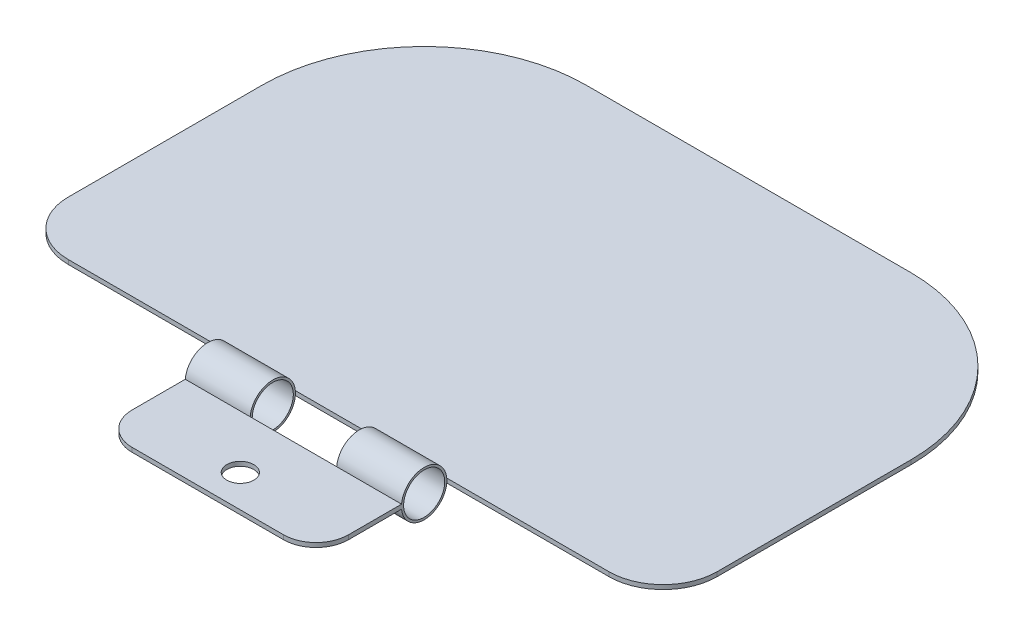
ISO-10303-21;
HEADER;
FILE_DESCRIPTION(('STEP AP214'),'2;1');
FILE_NAME('part.step','',(''),(''),'','','');
FILE_SCHEMA(('AUTOMOTIVE_DESIGN { 1 0 10303 214 1 1 1 1 }'));
ENDSEC;
DATA;
#1=APPLICATION_CONTEXT('core data for automotive mechanical design processes');
#2=APPLICATION_PROTOCOL_DEFINITION('international standard','automotive_design',2000,#1);
#3=PRODUCT_CONTEXT('',#1,'mechanical');
#4=PRODUCT('Part','Part','',(#3));
#5=PRODUCT_RELATED_PRODUCT_CATEGORY('part','',(#4));
#6=PRODUCT_DEFINITION_FORMATION('','',#4);
#7=PRODUCT_DEFINITION_CONTEXT('part definition',#1,'design');
#8=PRODUCT_DEFINITION('design','',#6,#7);
#9=PRODUCT_DEFINITION_SHAPE('','',#8);
#10=(LENGTH_UNIT() NAMED_UNIT(*) SI_UNIT(.MILLI.,.METRE.));
#11=(NAMED_UNIT(*) PLANE_ANGLE_UNIT() SI_UNIT($,.RADIAN.));
#12=(NAMED_UNIT(*) SI_UNIT($,.STERADIAN.) SOLID_ANGLE_UNIT());
#13=UNCERTAINTY_MEASURE_WITH_UNIT(LENGTH_MEASURE(1.E-05),#10,'distance_accuracy_value','');
#14=(GEOMETRIC_REPRESENTATION_CONTEXT(3) GLOBAL_UNCERTAINTY_ASSIGNED_CONTEXT((#13)) GLOBAL_UNIT_ASSIGNED_CONTEXT((#10,
#11,#12)) REPRESENTATION_CONTEXT('',''));
#15=CARTESIAN_POINT('',(0.,0.,0.));
#16=DIRECTION('',(0.,0.,1.));
#17=DIRECTION('',(1.,0.,0.));
#18=AXIS2_PLACEMENT_3D('',#15,#16,#17);
#19=CARTESIAN_POINT('',(20.,0.,0.));
#20=DIRECTION('',(-1.,0.,0.));
#21=DIRECTION('',(0.,0.,1.));
#22=AXIS2_PLACEMENT_3D('',#19,#20,#21);
#23=CYLINDRICAL_SURFACE('',#22,2.1);
#24=DIRECTION('',(-1.,0.,0.));
#25=VECTOR('',#24,1.);
#26=CARTESIAN_POINT('',(20.,-0.200000000000001,-2.09045449603669));
#27=LINE('',#26,#25);
#28=CARTESIAN_POINT('',(6.,-0.200000000000001,-2.09045449603669));
#29=VERTEX_POINT('',#28);
#30=CARTESIAN_POINT('',(0.,-0.200000000000001,-2.09045449603669));
#31=VERTEX_POINT('',#30);
#32=EDGE_CURVE('E177',#29,#31,#27,.T.);
#33=ORIENTED_EDGE('',*,*,#32,.F.);
#34=CARTESIAN_POINT('',(6.,0.,0.));
#35=DIRECTION('',(-1.,0.,0.));
#36=DIRECTION('',(0.,0.,1.));
#37=AXIS2_PLACEMENT_3D('',#34,#35,#36);
#38=CIRCLE('',#37,2.1);
#39=CARTESIAN_POINT('',(6.,-0.199999999999999,2.09045449603669));
#40=VERTEX_POINT('',#39);
#41=EDGE_CURVE('E172',#29,#40,#38,.T.);
#42=ORIENTED_EDGE('',*,*,#41,.T.);
#43=DIRECTION('',(-1.,0.,0.));
#44=VECTOR('',#43,1.);
#45=CARTESIAN_POINT('',(20.,-0.2,2.09045449603669));
#46=LINE('',#45,#44);
#47=CARTESIAN_POINT('',(0.,-0.2,2.09045449603669));
#48=VERTEX_POINT('',#47);
#49=EDGE_CURVE('E175',#40,#48,#46,.T.);
#50=ORIENTED_EDGE('',*,*,#49,.T.);
#51=CARTESIAN_POINT('',(0.,0.,0.));
#52=DIRECTION('',(1.,0.,0.));
#53=DIRECTION('',(0.,0.,-1.));
#54=AXIS2_PLACEMENT_3D('',#51,#52,#53);
#55=CIRCLE('',#54,2.1);
#56=EDGE_CURVE('E329',#48,#31,#55,.T.);
#57=ORIENTED_EDGE('',*,*,#56,.T.);
#58=EDGE_LOOP('',(#33,#42,#50,#57));
#59=FACE_BOUND('',#58,.T.);
#60=ADVANCED_FACE('F31',(#59),#23,.T.);
#61=CARTESIAN_POINT('',(20.,0.,0.));
#62=DIRECTION('',(-1.,0.,0.));
#63=DIRECTION('',(0.,0.,1.));
#64=AXIS2_PLACEMENT_3D('',#61,#62,#63);
#65=CYLINDRICAL_SURFACE('',#64,2.1);
#66=DIRECTION('',(-1.,0.,0.));
#67=VECTOR('',#66,1.);
#68=CARTESIAN_POINT('',(20.,0.2,2.09045449603669));
#69=LINE('',#68,#67);
#70=CARTESIAN_POINT('',(6.,0.2,2.09045449603669));
#71=VERTEX_POINT('',#70);
#72=CARTESIAN_POINT('',(0.,0.2,2.09045449603669));
#73=VERTEX_POINT('',#72);
#74=EDGE_CURVE('E338',#71,#73,#69,.T.);
#75=ORIENTED_EDGE('',*,*,#74,.F.);
#76=CARTESIAN_POINT('',(6.,0.,0.));
#77=DIRECTION('',(-1.,0.,0.));
#78=DIRECTION('',(0.,0.,1.));
#79=AXIS2_PLACEMENT_3D('',#76,#77,#78);
#80=CIRCLE('',#79,2.1);
#81=CARTESIAN_POINT('',(6.,0.199999999999999,-2.09045449603669));
#82=VERTEX_POINT('',#81);
#83=EDGE_CURVE('E180',#71,#82,#80,.T.);
#84=ORIENTED_EDGE('',*,*,#83,.T.);
#85=DIRECTION('',(-1.,0.,0.));
#86=VECTOR('',#85,1.);
#87=CARTESIAN_POINT('',(20.,0.2,-2.09045449603669));
#88=LINE('',#87,#86);
#89=CARTESIAN_POINT('',(0.,0.2,-2.09045449603669));
#90=VERTEX_POINT('',#89);
#91=EDGE_CURVE('E341',#82,#90,#88,.T.);
#92=ORIENTED_EDGE('',*,*,#91,.T.);
#93=CARTESIAN_POINT('',(0.,0.,0.));
#94=DIRECTION('',(1.,0.,0.));
#95=DIRECTION('',(0.,0.,-1.));
#96=AXIS2_PLACEMENT_3D('',#93,#94,#95);
#97=CIRCLE('',#96,2.1);
#98=EDGE_CURVE('E331',#90,#73,#97,.T.);
#99=ORIENTED_EDGE('',*,*,#98,.T.);
#100=EDGE_LOOP('',(#75,#84,#92,#99));
#101=FACE_BOUND('',#100,.T.);
#102=ADVANCED_FACE('F369',(#101),#65,.T.);
#103=CARTESIAN_POINT('',(20.,0.,0.));
#104=DIRECTION('',(-1.,0.,0.));
#105=DIRECTION('',(0.,0.,1.));
#106=AXIS2_PLACEMENT_3D('',#103,#104,#105);
#107=CYLINDRICAL_SURFACE('',#106,1.9);
#108=CARTESIAN_POINT('',(14.,0.,0.));
#109=DIRECTION('',(1.,0.,0.));
#110=DIRECTION('',(0.,0.,-1.));
#111=AXIS2_PLACEMENT_3D('',#108,#109,#110);
#112=CIRCLE('',#111,1.9);
#113=CARTESIAN_POINT('',(14.,0.,-1.9));
#114=VERTEX_POINT('',#113);
#115=EDGE_CURVE('E35',#114,#114,#112,.T.);
#116=ORIENTED_EDGE('',*,*,#115,.F.);
#117=EDGE_LOOP('',(#116));
#118=FACE_BOUND('',#117,.T.);
#119=CARTESIAN_POINT('',(20.,0.,0.));
#120=DIRECTION('',(1.,0.,0.));
#121=DIRECTION('',(0.,0.,-1.));
#122=AXIS2_PLACEMENT_3D('',#119,#120,#121);
#123=CIRCLE('',#122,1.9);
#124=CARTESIAN_POINT('',(20.,0.,-1.9));
#125=VERTEX_POINT('',#124);
#126=EDGE_CURVE('E312',#125,#125,#123,.T.);
#127=ORIENTED_EDGE('',*,*,#126,.T.);
#128=EDGE_LOOP('',(#127));
#129=FACE_BOUND('',#128,.T.);
#130=ADVANCED_FACE('F448',(#118,#129),#107,.F.);
#131=CARTESIAN_POINT('',(20.,0.,0.));
#132=DIRECTION('',(1.,0.,0.));
#133=DIRECTION('',(0.,0.,-1.));
#134=AXIS2_PLACEMENT_3D('',#131,#132,#133);
#135=PLANE('',#134);
#136=DIRECTION('',(0.,0.,1.));
#137=VECTOR('',#136,1.);
#138=CARTESIAN_POINT('',(20.,0.2,10.));
#139=LINE('',#138,#137);
#140=CARTESIAN_POINT('',(20.,0.2,2.09045449603669));
#141=VERTEX_POINT('',#140);
#142=CARTESIAN_POINT('',(20.,0.2,7.));
#143=VERTEX_POINT('',#142);
#144=EDGE_CURVE('E324',#141,#143,#139,.T.);
#145=ORIENTED_EDGE('',*,*,#144,.T.);
#146=DIRECTION('',(0.,-1.,0.));
#147=VECTOR('',#146,1.);
#148=CARTESIAN_POINT('',(20.,-0.2,7.));
#149=LINE('',#148,#147);
#150=CARTESIAN_POINT('',(20.,-0.2,7.));
#151=VERTEX_POINT('',#150);
#152=EDGE_CURVE('E250',#143,#151,#149,.T.);
#153=ORIENTED_EDGE('',*,*,#152,.T.);
#154=DIRECTION('',(0.,0.,-1.));
#155=VECTOR('',#154,1.);
#156=CARTESIAN_POINT('',(20.,-0.2,10.));
#157=LINE('',#156,#155);
#158=CARTESIAN_POINT('',(20.,-0.2,2.09045449603669));
#159=VERTEX_POINT('',#158);
#160=EDGE_CURVE('E317',#151,#159,#157,.T.);
#161=ORIENTED_EDGE('',*,*,#160,.T.);
#162=CARTESIAN_POINT('',(20.,0.,0.));
#163=DIRECTION('',(1.,0.,0.));
#164=DIRECTION('',(0.,0.,-1.));
#165=AXIS2_PLACEMENT_3D('',#162,#163,#164);
#166=CIRCLE('',#165,2.1);
#167=CARTESIAN_POINT('',(20.,-0.200000000000001,-2.09045449603669));
#168=VERTEX_POINT('',#167);
#169=EDGE_CURVE('E319',#159,#168,#166,.T.);
#170=ORIENTED_EDGE('',*,*,#169,.T.);
#171=DIRECTION('',(0.,-1.,0.));
#172=VECTOR('',#171,1.);
#173=CARTESIAN_POINT('',(20.,0.,-2.09045449603669));
#174=LINE('',#173,#172);
#175=CARTESIAN_POINT('',(20.,0.2,-2.09045449603669));
#176=VERTEX_POINT('',#175);
#177=EDGE_CURVE('E308',#176,#168,#174,.T.);
#178=ORIENTED_EDGE('',*,*,#177,.F.);
#179=CARTESIAN_POINT('',(20.,0.,0.));
#180=DIRECTION('',(1.,0.,0.));
#181=DIRECTION('',(0.,0.,-1.));
#182=AXIS2_PLACEMENT_3D('',#179,#180,#181);
#183=CIRCLE('',#182,2.1);
#184=EDGE_CURVE('E322',#176,#141,#183,.T.);
#185=ORIENTED_EDGE('',*,*,#184,.T.);
#186=EDGE_LOOP('',(#145,#153,#161,#170,#178,#185));
#187=FACE_BOUND('',#186,.T.);
#188=ORIENTED_EDGE('',*,*,#126,.F.);
#189=EDGE_LOOP('',(#188));
#190=FACE_BOUND('',#189,.T.);
#191=ADVANCED_FACE('F409',(#187,#190),#135,.T.);
#192=CARTESIAN_POINT('',(0.,0.,0.));
#193=DIRECTION('',(1.,0.,0.));
#194=DIRECTION('',(0.,0.,-1.));
#195=AXIS2_PLACEMENT_3D('',#192,#193,#194);
#196=PLANE('',#195);
#197=DIRECTION('',(0.,0.,-1.));
#198=VECTOR('',#197,1.);
#199=CARTESIAN_POINT('',(0.,-0.2,10.));
#200=LINE('',#199,#198);
#201=CARTESIAN_POINT('',(0.,-0.2,7.));
#202=VERTEX_POINT('',#201);
#203=EDGE_CURVE('E200',#202,#48,#200,.T.);
#204=ORIENTED_EDGE('',*,*,#203,.F.);
#205=DIRECTION('',(0.,-1.,0.));
#206=VECTOR('',#205,1.);
#207=CARTESIAN_POINT('',(0.,0.,7.));
#208=LINE('',#207,#206);
#209=CARTESIAN_POINT('',(0.,0.2,7.));
#210=VERTEX_POINT('',#209);
#211=EDGE_CURVE('E11',#202,#210,#208,.F.);
#212=ORIENTED_EDGE('',*,*,#211,.T.);
#213=DIRECTION('',(0.,0.,1.));
#214=VECTOR('',#213,1.);
#215=CARTESIAN_POINT('',(0.,0.2,10.));
#216=LINE('',#215,#214);
#217=EDGE_CURVE('E320',#73,#210,#216,.T.);
#218=ORIENTED_EDGE('',*,*,#217,.F.);
#219=ORIENTED_EDGE('',*,*,#98,.F.);
#220=DIRECTION('',(0.,-1.,0.));
#221=VECTOR('',#220,1.);
#222=CARTESIAN_POINT('',(0.,0.,-2.09045449603669));
#223=LINE('',#222,#221);
#224=EDGE_CURVE('E301',#90,#31,#223,.T.);
#225=ORIENTED_EDGE('',*,*,#224,.T.);
#226=ORIENTED_EDGE('',*,*,#56,.F.);
#227=EDGE_LOOP('',(#204,#212,#218,#219,#225,#226));
#228=FACE_BOUND('',#227,.T.);
#229=CARTESIAN_POINT('',(0.,0.,0.));
#230=DIRECTION('',(1.,0.,0.));
#231=DIRECTION('',(0.,0.,-1.));
#232=AXIS2_PLACEMENT_3D('',#229,#230,#231);
#233=CIRCLE('',#232,1.9);
#234=CARTESIAN_POINT('',(0.,0.,-1.9));
#235=VERTEX_POINT('',#234);
#236=EDGE_CURVE('E311',#235,#235,#233,.T.);
#237=ORIENTED_EDGE('',*,*,#236,.T.);
#238=EDGE_LOOP('',(#237));
#239=FACE_BOUND('',#238,.T.);
#240=ADVANCED_FACE('F365',(#228,#239),#196,.F.);
#241=CARTESIAN_POINT('',(20.,0.2,10.));
#242=DIRECTION('',(0.,0.,-1.));
#243=DIRECTION('',(-1.,0.,0.));
#244=AXIS2_PLACEMENT_3D('',#241,#242,#243);
#245=PLANE('',#244);
#246=DIRECTION('',(-1.,0.,0.));
#247=VECTOR('',#246,1.);
#248=CARTESIAN_POINT('',(20.,-0.2,10.));
#249=LINE('',#248,#247);
#250=CARTESIAN_POINT('',(17.,-0.2,10.));
#251=VERTEX_POINT('',#250);
#252=CARTESIAN_POINT('',(3.,-0.2,10.));
#253=VERTEX_POINT('',#252);
#254=EDGE_CURVE('E205',#251,#253,#249,.T.);
#255=ORIENTED_EDGE('',*,*,#254,.F.);
#256=DIRECTION('',(0.,-1.,0.));
#257=VECTOR('',#256,1.);
#258=CARTESIAN_POINT('',(17.,0.2,10.));
#259=LINE('',#258,#257);
#260=CARTESIAN_POINT('',(17.,0.2,10.));
#261=VERTEX_POINT('',#260);
#262=EDGE_CURVE('E260',#251,#261,#259,.F.);
#263=ORIENTED_EDGE('',*,*,#262,.T.);
#264=DIRECTION('',(-1.,0.,0.));
#265=VECTOR('',#264,1.);
#266=CARTESIAN_POINT('',(20.,0.2,10.));
#267=LINE('',#266,#265);
#268=CARTESIAN_POINT('',(3.,0.2,10.));
#269=VERTEX_POINT('',#268);
#270=EDGE_CURVE('E327',#261,#269,#267,.T.);
#271=ORIENTED_EDGE('',*,*,#270,.T.);
#272=DIRECTION('',(0.,-1.,0.));
#273=VECTOR('',#272,1.);
#274=CARTESIAN_POINT('',(3.,0.2,10.));
#275=LINE('',#274,#273);
#276=EDGE_CURVE('E257',#269,#253,#275,.T.);
#277=ORIENTED_EDGE('',*,*,#276,.T.);
#278=EDGE_LOOP('',(#255,#263,#271,#277));
#279=FACE_BOUND('',#278,.T.);
#280=ADVANCED_FACE('F428',(#279),#245,.F.);
#281=CARTESIAN_POINT('',(20.,-0.2,10.));
#282=DIRECTION('',(0.,1.,0.));
#283=DIRECTION('',(0.,0.,1.));
#284=AXIS2_PLACEMENT_3D('',#281,#282,#283);
#285=PLANE('',#284);
#286=CARTESIAN_POINT('',(10.,-0.199999999999999,7.));
#287=DIRECTION('',(0.,1.,0.));
#288=DIRECTION('',(0.,0.,1.));
#289=AXIS2_PLACEMENT_3D('',#286,#287,#288);
#290=CIRCLE('',#289,1.25);
#291=CARTESIAN_POINT('',(10.,-0.199999999999999,8.25));
#292=VERTEX_POINT('',#291);
#293=EDGE_CURVE('E284',#292,#292,#290,.T.);
#294=ORIENTED_EDGE('',*,*,#293,.T.);
#295=EDGE_LOOP('',(#294));
#296=FACE_BOUND('',#295,.T.);
#297=ORIENTED_EDGE('',*,*,#160,.F.);
#298=CARTESIAN_POINT('',(17.,-0.2,7.));
#299=DIRECTION('',(0.,1.,0.));
#300=DIRECTION('',(0.,0.,1.));
#301=AXIS2_PLACEMENT_3D('',#298,#299,#300);
#302=CIRCLE('',#301,3.);
#303=EDGE_CURVE('E255',#151,#251,#302,.F.);
#304=ORIENTED_EDGE('',*,*,#303,.T.);
#305=ORIENTED_EDGE('',*,*,#254,.T.);
#306=CARTESIAN_POINT('',(3.,-0.2,7.));
#307=DIRECTION('',(0.,1.,0.));
#308=DIRECTION('',(0.,0.,1.));
#309=AXIS2_PLACEMENT_3D('',#306,#307,#308);
#310=CIRCLE('',#309,3.);
#311=EDGE_CURVE('E253',#253,#202,#310,.F.);
#312=ORIENTED_EDGE('',*,*,#311,.T.);
#313=ORIENTED_EDGE('',*,*,#203,.T.);
#314=ORIENTED_EDGE('',*,*,#49,.F.);
#315=DIRECTION('',(-1.,0.,0.));
#316=VECTOR('',#315,1.);
#317=CARTESIAN_POINT('',(20.,-0.199999999999999,2.09045449603669));
#318=LINE('',#317,#316);
#319=CARTESIAN_POINT('',(14.,-0.199999999999999,2.09045449603669));
#320=VERTEX_POINT('',#319);
#321=EDGE_CURVE('E184',#40,#320,#318,.F.);
#322=ORIENTED_EDGE('',*,*,#321,.T.);
#323=EDGE_CURVE('E202',#159,#320,#46,.T.);
#324=ORIENTED_EDGE('',*,*,#323,.F.);
#325=EDGE_LOOP('',(#297,#304,#305,#312,#313,#314,#322,#324));
#326=FACE_BOUND('',#325,.T.);
#327=ADVANCED_FACE('F198',(#296,#326),#285,.F.);
#328=ORIENTED_EDGE('',*,*,#323,.T.);
#329=CARTESIAN_POINT('',(14.,0.,0.));
#330=DIRECTION('',(1.,0.,0.));
#331=DIRECTION('',(0.,0.,-1.));
#332=AXIS2_PLACEMENT_3D('',#329,#330,#331);
#333=CIRCLE('',#332,2.1);
#334=CARTESIAN_POINT('',(14.,-0.2,-2.09045449603669));
#335=VERTEX_POINT('',#334);
#336=EDGE_CURVE('E192',#320,#335,#333,.T.);
#337=ORIENTED_EDGE('',*,*,#336,.T.);
#338=EDGE_CURVE('E203',#168,#335,#27,.T.);
#339=ORIENTED_EDGE('',*,*,#338,.F.);
#340=ORIENTED_EDGE('',*,*,#169,.F.);
#341=EDGE_LOOP('',(#328,#337,#339,#340));
#342=FACE_BOUND('',#341,.T.);
#343=ADVANCED_FACE('F444',(#342),#23,.T.);
#344=CARTESIAN_POINT('',(20.,-0.2,-2.09045449603669));
#345=DIRECTION('',(0.,1.,0.));
#346=DIRECTION('',(0.,0.,1.));
#347=AXIS2_PLACEMENT_3D('',#344,#345,#346);
#348=PLANE('',#347);
#349=DIRECTION('',(0.,0.,-1.));
#350=VECTOR('',#349,1.);
#351=CARTESIAN_POINT('',(40.,-0.2,-40.));
#352=LINE('',#351,#350);
#353=CARTESIAN_POINT('',(40.,-0.200000000000001,-7.09045449603669));
#354=VERTEX_POINT('',#353);
#355=CARTESIAN_POINT('',(40.,-0.2,-25.));
#356=VERTEX_POINT('',#355);
#357=EDGE_CURVE('E287',#354,#356,#352,.T.);
#358=ORIENTED_EDGE('',*,*,#357,.F.);
#359=CARTESIAN_POINT('',(35.,-0.2,-7.09045449603669));
#360=DIRECTION('',(0.,1.,0.));
#361=DIRECTION('',(0.,0.,1.));
#362=AXIS2_PLACEMENT_3D('',#359,#360,#361);
#363=CIRCLE('',#362,5.);
#364=CARTESIAN_POINT('',(35.,-0.200000000000001,-2.09045449603669));
#365=VERTEX_POINT('',#364);
#366=EDGE_CURVE('E237',#354,#365,#363,.F.);
#367=ORIENTED_EDGE('',*,*,#366,.T.);
#368=DIRECTION('',(1.,0.,0.));
#369=VECTOR('',#368,1.);
#370=CARTESIAN_POINT('',(-20.,-0.200000000000001,-2.09045449603669));
#371=LINE('',#370,#369);
#372=EDGE_CURVE('E302',#168,#365,#371,.T.);
#373=ORIENTED_EDGE('',*,*,#372,.F.);
#374=ORIENTED_EDGE('',*,*,#338,.T.);
#375=DIRECTION('',(-1.,0.,0.));
#376=VECTOR('',#375,1.);
#377=CARTESIAN_POINT('',(20.,-0.2,-2.09045449603669));
#378=LINE('',#377,#376);
#379=EDGE_CURVE('E191',#335,#29,#378,.T.);
#380=ORIENTED_EDGE('',*,*,#379,.T.);
#381=ORIENTED_EDGE('',*,*,#32,.T.);
#382=CARTESIAN_POINT('',(-15.,-0.200000000000001,-2.09045449603669));
#383=VERTEX_POINT('',#382);
#384=EDGE_CURVE('E298',#383,#31,#371,.T.);
#385=ORIENTED_EDGE('',*,*,#384,.F.);
#386=CARTESIAN_POINT('',(-15.,-0.2,-7.09045449603669));
#387=DIRECTION('',(0.,1.,0.));
#388=DIRECTION('',(0.,0.,1.));
#389=AXIS2_PLACEMENT_3D('',#386,#387,#388);
#390=CIRCLE('',#389,5.);
#391=CARTESIAN_POINT('',(-20.,-0.200000000000001,-7.09045449603669));
#392=VERTEX_POINT('',#391);
#393=EDGE_CURVE('E235',#383,#392,#390,.F.);
#394=ORIENTED_EDGE('',*,*,#393,.T.);
#395=DIRECTION('',(0.,0.,-1.));
#396=VECTOR('',#395,1.);
#397=CARTESIAN_POINT('',(-20.,-0.2,-40.));
#398=LINE('',#397,#396);
#399=CARTESIAN_POINT('',(-20.,-0.2,-25.));
#400=VERTEX_POINT('',#399);
#401=EDGE_CURVE('E292',#392,#400,#398,.T.);
#402=ORIENTED_EDGE('',*,*,#401,.T.);
#403=CARTESIAN_POINT('',(-5.,-0.2,-25.));
#404=DIRECTION('',(0.,1.,0.));
#405=DIRECTION('',(0.,0.,1.));
#406=AXIS2_PLACEMENT_3D('',#403,#404,#405);
#407=CIRCLE('',#406,15.);
#408=CARTESIAN_POINT('',(-5.,-0.2,-40.));
#409=VERTEX_POINT('',#408);
#410=EDGE_CURVE('E224',#400,#409,#407,.F.);
#411=ORIENTED_EDGE('',*,*,#410,.T.);
#412=DIRECTION('',(-1.,0.,0.));
#413=VECTOR('',#412,1.);
#414=CARTESIAN_POINT('',(20.,-0.2,-40.));
#415=LINE('',#414,#413);
#416=CARTESIAN_POINT('',(25.,-0.2,-40.));
#417=VERTEX_POINT('',#416);
#418=EDGE_CURVE('E349',#417,#409,#415,.T.);
#419=ORIENTED_EDGE('',*,*,#418,.F.);
#420=CARTESIAN_POINT('',(25.,-0.2,-25.));
#421=DIRECTION('',(0.,1.,0.));
#422=DIRECTION('',(0.,0.,1.));
#423=AXIS2_PLACEMENT_3D('',#420,#421,#422);
#424=CIRCLE('',#423,15.);
#425=EDGE_CURVE('E226',#417,#356,#424,.F.);
#426=ORIENTED_EDGE('',*,*,#425,.T.);
#427=EDGE_LOOP('',(#358,#367,#373,#374,#380,#381,#385,#394,#402,#411,#419,#426));
#428=FACE_BOUND('',#427,.T.);
#429=ADVANCED_FACE('F357',(#428),#348,.F.);
#430=CARTESIAN_POINT('',(20.,0.2,-40.));
#431=DIRECTION('',(0.,0.,1.));
#432=DIRECTION('',(1.,0.,0.));
#433=AXIS2_PLACEMENT_3D('',#430,#431,#432);
#434=PLANE('',#433);
#435=DIRECTION('',(-1.,0.,0.));
#436=VECTOR('',#435,1.);
#437=CARTESIAN_POINT('',(20.,0.2,-40.));
#438=LINE('',#437,#436);
#439=CARTESIAN_POINT('',(25.,0.2,-40.));
#440=VERTEX_POINT('',#439);
#441=CARTESIAN_POINT('',(-5.,0.2,-40.));
#442=VERTEX_POINT('',#441);
#443=EDGE_CURVE('E346',#440,#442,#438,.T.);
#444=ORIENTED_EDGE('',*,*,#443,.F.);
#445=DIRECTION('',(0.,1.,0.));
#446=VECTOR('',#445,1.);
#447=CARTESIAN_POINT('',(25.,0.2,-40.));
#448=LINE('',#447,#446);
#449=EDGE_CURVE('E222',#440,#417,#448,.F.);
#450=ORIENTED_EDGE('',*,*,#449,.T.);
#451=ORIENTED_EDGE('',*,*,#418,.T.);
#452=DIRECTION('',(0.,1.,0.));
#453=VECTOR('',#452,1.);
#454=CARTESIAN_POINT('',(-5.,0.2,-40.));
#455=LINE('',#454,#453);
#456=EDGE_CURVE('E219',#409,#442,#455,.T.);
#457=ORIENTED_EDGE('',*,*,#456,.T.);
#458=EDGE_LOOP('',(#444,#450,#451,#457));
#459=FACE_BOUND('',#458,.T.);
#460=ADVANCED_FACE('F458',(#459),#434,.F.);
#461=CARTESIAN_POINT('',(20.,0.2,-2.09045449603669));
#462=DIRECTION('',(0.,-1.,0.));
#463=DIRECTION('',(0.,0.,-1.));
#464=AXIS2_PLACEMENT_3D('',#461,#462,#463);
#465=PLANE('',#464);
#466=DIRECTION('',(1.,0.,0.));
#467=VECTOR('',#466,1.);
#468=CARTESIAN_POINT('',(-20.,0.2,-2.09045449603669));
#469=LINE('',#468,#467);
#470=CARTESIAN_POINT('',(35.,0.2,-2.09045449603669));
#471=VERTEX_POINT('',#470);
#472=EDGE_CURVE('E297',#176,#471,#469,.T.);
#473=ORIENTED_EDGE('',*,*,#472,.T.);
#474=CARTESIAN_POINT('',(35.,0.2,-7.09045449603669));
#475=DIRECTION('',(0.,-1.,0.));
#476=DIRECTION('',(0.,0.,-1.));
#477=AXIS2_PLACEMENT_3D('',#474,#475,#476);
#478=CIRCLE('',#477,5.);
#479=CARTESIAN_POINT('',(40.,0.2,-7.09045449603669));
#480=VERTEX_POINT('',#479);
#481=EDGE_CURVE('E243',#471,#480,#478,.F.);
#482=ORIENTED_EDGE('',*,*,#481,.T.);
#483=DIRECTION('',(0.,0.,1.));
#484=VECTOR('',#483,1.);
#485=CARTESIAN_POINT('',(40.,0.2,-2.09045449603669));
#486=LINE('',#485,#484);
#487=CARTESIAN_POINT('',(40.,0.2,-25.));
#488=VERTEX_POINT('',#487);
#489=EDGE_CURVE('E289',#488,#480,#486,.T.);
#490=ORIENTED_EDGE('',*,*,#489,.F.);
#491=CARTESIAN_POINT('',(25.,0.2,-25.));
#492=DIRECTION('',(0.,-1.,0.));
#493=DIRECTION('',(0.,0.,-1.));
#494=AXIS2_PLACEMENT_3D('',#491,#492,#493);
#495=CIRCLE('',#494,15.);
#496=EDGE_CURVE('E217',#488,#440,#495,.F.);
#497=ORIENTED_EDGE('',*,*,#496,.T.);
#498=ORIENTED_EDGE('',*,*,#443,.T.);
#499=CARTESIAN_POINT('',(-5.,0.2,-25.));
#500=DIRECTION('',(0.,-1.,0.));
#501=DIRECTION('',(0.,0.,-1.));
#502=AXIS2_PLACEMENT_3D('',#499,#500,#501);
#503=CIRCLE('',#502,15.);
#504=CARTESIAN_POINT('',(-20.,0.2,-25.));
#505=VERTEX_POINT('',#504);
#506=EDGE_CURVE('E215',#442,#505,#503,.F.);
#507=ORIENTED_EDGE('',*,*,#506,.T.);
#508=DIRECTION('',(0.,0.,1.));
#509=VECTOR('',#508,1.);
#510=CARTESIAN_POINT('',(-20.,0.2,-2.09045449603669));
#511=LINE('',#510,#509);
#512=CARTESIAN_POINT('',(-20.,0.2,-7.09045449603669));
#513=VERTEX_POINT('',#512);
#514=EDGE_CURVE('E294',#505,#513,#511,.T.);
#515=ORIENTED_EDGE('',*,*,#514,.T.);
#516=CARTESIAN_POINT('',(-15.,0.2,-7.09045449603669));
#517=DIRECTION('',(0.,-1.,0.));
#518=DIRECTION('',(0.,0.,-1.));
#519=AXIS2_PLACEMENT_3D('',#516,#517,#518);
#520=CIRCLE('',#519,5.);
#521=CARTESIAN_POINT('',(-15.,0.2,-2.09045449603669));
#522=VERTEX_POINT('',#521);
#523=EDGE_CURVE('E241',#513,#522,#520,.F.);
#524=ORIENTED_EDGE('',*,*,#523,.T.);
#525=EDGE_CURVE('E303',#522,#90,#469,.T.);
#526=ORIENTED_EDGE('',*,*,#525,.T.);
#527=ORIENTED_EDGE('',*,*,#91,.F.);
#528=CARTESIAN_POINT('',(14.,0.199999999999999,-2.09045449603669));
#529=VERTEX_POINT('',#528);
#530=EDGE_CURVE('E347',#529,#82,#88,.T.);
#531=ORIENTED_EDGE('',*,*,#530,.F.);
#532=EDGE_CURVE('E343',#176,#529,#88,.T.);
#533=ORIENTED_EDGE('',*,*,#532,.F.);
#534=EDGE_LOOP('',(#473,#482,#490,#497,#498,#507,#515,#524,#526,#527,#531,#533));
#535=FACE_BOUND('',#534,.T.);
#536=ADVANCED_FACE('F375',(#535),#465,.F.);
#537=ORIENTED_EDGE('',*,*,#532,.T.);
#538=CARTESIAN_POINT('',(14.,0.,0.));
#539=DIRECTION('',(1.,0.,0.));
#540=DIRECTION('',(0.,0.,-1.));
#541=AXIS2_PLACEMENT_3D('',#538,#539,#540);
#542=CIRCLE('',#541,2.1);
#543=CARTESIAN_POINT('',(14.,0.2,2.09045449603669));
#544=VERTEX_POINT('',#543);
#545=EDGE_CURVE('E277',#529,#544,#542,.T.);
#546=ORIENTED_EDGE('',*,*,#545,.T.);
#547=EDGE_CURVE('E339',#141,#544,#69,.T.);
#548=ORIENTED_EDGE('',*,*,#547,.F.);
#549=ORIENTED_EDGE('',*,*,#184,.F.);
#550=EDGE_LOOP('',(#537,#546,#548,#549));
#551=FACE_BOUND('',#550,.T.);
#552=ADVANCED_FACE('F416',(#551),#65,.T.);
#553=CARTESIAN_POINT('',(20.,0.2,10.));
#554=DIRECTION('',(0.,-1.,0.));
#555=DIRECTION('',(0.,0.,-1.));
#556=AXIS2_PLACEMENT_3D('',#553,#554,#555);
#557=PLANE('',#556);
#558=CARTESIAN_POINT('',(10.,0.2,7.));
#559=DIRECTION('',(0.,1.,0.));
#560=DIRECTION('',(0.,0.,1.));
#561=AXIS2_PLACEMENT_3D('',#558,#559,#560);
#562=CIRCLE('',#561,1.25);
#563=CARTESIAN_POINT('',(10.,0.2,8.25));
#564=VERTEX_POINT('',#563);
#565=EDGE_CURVE('E281',#564,#564,#562,.T.);
#566=ORIENTED_EDGE('',*,*,#565,.F.);
#567=EDGE_LOOP('',(#566));
#568=FACE_BOUND('',#567,.T.);
#569=ORIENTED_EDGE('',*,*,#270,.F.);
#570=CARTESIAN_POINT('',(17.,0.2,7.));
#571=DIRECTION('',(0.,-1.,0.));
#572=DIRECTION('',(0.,0.,-1.));
#573=AXIS2_PLACEMENT_3D('',#570,#571,#572);
#574=CIRCLE('',#573,3.);
#575=EDGE_CURVE('E40',#261,#143,#574,.F.);
#576=ORIENTED_EDGE('',*,*,#575,.T.);
#577=ORIENTED_EDGE('',*,*,#144,.F.);
#578=ORIENTED_EDGE('',*,*,#547,.T.);
#579=EDGE_CURVE('E342',#544,#71,#69,.T.);
#580=ORIENTED_EDGE('',*,*,#579,.T.);
#581=ORIENTED_EDGE('',*,*,#74,.T.);
#582=ORIENTED_EDGE('',*,*,#217,.T.);
#583=CARTESIAN_POINT('',(3.,0.2,7.));
#584=DIRECTION('',(0.,-1.,0.));
#585=DIRECTION('',(0.,0.,-1.));
#586=AXIS2_PLACEMENT_3D('',#583,#584,#585);
#587=CIRCLE('',#586,3.);
#588=EDGE_CURVE('E262',#210,#269,#587,.F.);
#589=ORIENTED_EDGE('',*,*,#588,.T.);
#590=EDGE_LOOP('',(#569,#576,#577,#578,#580,#581,#582,#589));
#591=FACE_BOUND('',#590,.T.);
#592=ADVANCED_FACE('F420',(#568,#591),#557,.F.);
#593=CARTESIAN_POINT('',(6.,0.,0.));
#594=DIRECTION('',(-1.,0.,0.));
#595=DIRECTION('',(0.,0.,1.));
#596=AXIS2_PLACEMENT_3D('',#593,#594,#595);
#597=CIRCLE('',#596,1.9);
#598=CARTESIAN_POINT('',(6.,0.,1.9));
#599=VERTEX_POINT('',#598);
#600=EDGE_CURVE('E264',#599,#599,#597,.T.);
#601=ORIENTED_EDGE('',*,*,#600,.F.);
#602=EDGE_LOOP('',(#601));
#603=FACE_BOUND('',#602,.T.);
#604=ORIENTED_EDGE('',*,*,#236,.F.);
#605=EDGE_LOOP('',(#604));
#606=FACE_BOUND('',#605,.T.);
#607=ADVANCED_FACE('F478',(#603,#606),#107,.F.);
#608=CARTESIAN_POINT('',(-20.,-0.200000000000001,-2.09045449603669));
#609=DIRECTION('',(-1.,0.,0.));
#610=DIRECTION('',(0.,0.,1.));
#611=AXIS2_PLACEMENT_3D('',#608,#609,#610);
#612=PLANE('',#611);
#613=ORIENTED_EDGE('',*,*,#401,.F.);
#614=DIRECTION('',(0.,-1.,0.));
#615=VECTOR('',#614,1.);
#616=CARTESIAN_POINT('',(-20.,-0.200000000000007,-7.09045449603669));
#617=LINE('',#616,#615);
#618=EDGE_CURVE('E248',#392,#513,#617,.F.);
#619=ORIENTED_EDGE('',*,*,#618,.T.);
#620=ORIENTED_EDGE('',*,*,#514,.F.);
#621=DIRECTION('',(0.,1.,0.));
#622=VECTOR('',#621,1.);
#623=CARTESIAN_POINT('',(-20.,-0.2,-25.));
#624=LINE('',#623,#622);
#625=EDGE_CURVE('E229',#505,#400,#624,.F.);
#626=ORIENTED_EDGE('',*,*,#625,.T.);
#627=EDGE_LOOP('',(#613,#619,#620,#626));
#628=FACE_BOUND('',#627,.T.);
#629=ADVANCED_FACE('F382',(#628),#612,.T.);
#630=CARTESIAN_POINT('',(-20.,-0.200000000000001,-2.09045449603669));
#631=DIRECTION('',(0.,0.,1.));
#632=DIRECTION('',(0.,-1.,0.));
#633=AXIS2_PLACEMENT_3D('',#630,#631,#632);
#634=PLANE('',#633);
#635=ORIENTED_EDGE('',*,*,#525,.F.);
#636=DIRECTION('',(0.,-1.,0.));
#637=VECTOR('',#636,1.);
#638=CARTESIAN_POINT('',(-15.,-0.200000000000001,-2.09045449603669));
#639=LINE('',#638,#637);
#640=EDGE_CURVE('E245',#522,#383,#639,.T.);
#641=ORIENTED_EDGE('',*,*,#640,.T.);
#642=ORIENTED_EDGE('',*,*,#384,.T.);
#643=ORIENTED_EDGE('',*,*,#224,.F.);
#644=EDGE_LOOP('',(#635,#641,#642,#643));
#645=FACE_BOUND('',#644,.T.);
#646=ADVANCED_FACE('F361',(#645),#634,.T.);
#647=ORIENTED_EDGE('',*,*,#372,.T.);
#648=DIRECTION('',(0.,-1.,0.));
#649=VECTOR('',#648,1.);
#650=CARTESIAN_POINT('',(35.,0.2,-2.09045449603669));
#651=LINE('',#650,#649);
#652=EDGE_CURVE('E239',#365,#471,#651,.F.);
#653=ORIENTED_EDGE('',*,*,#652,.T.);
#654=ORIENTED_EDGE('',*,*,#472,.F.);
#655=ORIENTED_EDGE('',*,*,#177,.T.);
#656=EDGE_LOOP('',(#647,#653,#654,#655));
#657=FACE_BOUND('',#656,.T.);
#658=ADVANCED_FACE('F407',(#657),#634,.T.);
#659=CARTESIAN_POINT('',(40.,-0.200000000000001,-2.09045449603669));
#660=DIRECTION('',(-1.,0.,0.));
#661=DIRECTION('',(0.,0.,1.));
#662=AXIS2_PLACEMENT_3D('',#659,#660,#661);
#663=PLANE('',#662);
#664=ORIENTED_EDGE('',*,*,#489,.T.);
#665=DIRECTION('',(0.,-1.,0.));
#666=VECTOR('',#665,1.);
#667=CARTESIAN_POINT('',(40.,-0.200000000000007,-7.09045449603669));
#668=LINE('',#667,#666);
#669=EDGE_CURVE('E232',#480,#354,#668,.T.);
#670=ORIENTED_EDGE('',*,*,#669,.T.);
#671=ORIENTED_EDGE('',*,*,#357,.T.);
#672=DIRECTION('',(0.,1.,0.));
#673=VECTOR('',#672,1.);
#674=CARTESIAN_POINT('',(40.,-0.200000000000001,-25.));
#675=LINE('',#674,#673);
#676=EDGE_CURVE('E212',#356,#488,#675,.T.);
#677=ORIENTED_EDGE('',*,*,#676,.T.);
#678=EDGE_LOOP('',(#664,#670,#671,#677));
#679=FACE_BOUND('',#678,.T.);
#680=ADVANCED_FACE('F395',(#679),#663,.F.);
#681=CARTESIAN_POINT('',(25.,-0.200000000000001,-25.));
#682=DIRECTION('',(0.,1.,0.));
#683=DIRECTION('',(0.,0.,1.));
#684=AXIS2_PLACEMENT_3D('',#681,#682,#683);
#685=CYLINDRICAL_SURFACE('',#684,15.);
#686=ORIENTED_EDGE('',*,*,#425,.F.);
#687=ORIENTED_EDGE('',*,*,#449,.F.);
#688=ORIENTED_EDGE('',*,*,#496,.F.);
#689=ORIENTED_EDGE('',*,*,#676,.F.);
#690=EDGE_LOOP('',(#686,#687,#688,#689));
#691=FACE_BOUND('',#690,.T.);
#692=ADVANCED_FACE('F392',(#691),#685,.T.);
#693=CARTESIAN_POINT('',(-5.,0.2,-25.));
#694=DIRECTION('',(0.,-1.,0.));
#695=DIRECTION('',(0.,0.,-1.));
#696=AXIS2_PLACEMENT_3D('',#693,#694,#695);
#697=CYLINDRICAL_SURFACE('',#696,15.);
#698=ORIENTED_EDGE('',*,*,#410,.F.);
#699=ORIENTED_EDGE('',*,*,#625,.F.);
#700=ORIENTED_EDGE('',*,*,#506,.F.);
#701=ORIENTED_EDGE('',*,*,#456,.F.);
#702=EDGE_LOOP('',(#698,#699,#700,#701));
#703=FACE_BOUND('',#702,.T.);
#704=ADVANCED_FACE('F387',(#703),#697,.T.);
#705=CARTESIAN_POINT('',(35.,-0.200000000000007,-7.09045449603669));
#706=DIRECTION('',(0.,1.,0.));
#707=DIRECTION('',(0.,0.,1.));
#708=AXIS2_PLACEMENT_3D('',#705,#706,#707);
#709=CYLINDRICAL_SURFACE('',#708,5.);
#710=ORIENTED_EDGE('',*,*,#481,.F.);
#711=ORIENTED_EDGE('',*,*,#652,.F.);
#712=ORIENTED_EDGE('',*,*,#366,.F.);
#713=ORIENTED_EDGE('',*,*,#669,.F.);
#714=EDGE_LOOP('',(#710,#711,#712,#713));
#715=FACE_BOUND('',#714,.T.);
#716=ADVANCED_FACE('F403',(#715),#709,.T.);
#717=CARTESIAN_POINT('',(-15.,-0.200000000000007,-7.09045449603669));
#718=DIRECTION('',(0.,-1.,0.));
#719=DIRECTION('',(0.,0.,-1.));
#720=AXIS2_PLACEMENT_3D('',#717,#718,#719);
#721=CYLINDRICAL_SURFACE('',#720,5.);
#722=ORIENTED_EDGE('',*,*,#523,.F.);
#723=ORIENTED_EDGE('',*,*,#618,.F.);
#724=ORIENTED_EDGE('',*,*,#393,.F.);
#725=ORIENTED_EDGE('',*,*,#640,.F.);
#726=EDGE_LOOP('',(#722,#723,#724,#725));
#727=FACE_BOUND('',#726,.T.);
#728=ADVANCED_FACE('F378',(#727),#721,.T.);
#729=CARTESIAN_POINT('',(17.,0.,7.));
#730=DIRECTION('',(0.,1.,0.));
#731=DIRECTION('',(0.,0.,1.));
#732=AXIS2_PLACEMENT_3D('',#729,#730,#731);
#733=CYLINDRICAL_SURFACE('',#732,3.);
#734=ORIENTED_EDGE('',*,*,#575,.F.);
#735=ORIENTED_EDGE('',*,*,#262,.F.);
#736=ORIENTED_EDGE('',*,*,#303,.F.);
#737=ORIENTED_EDGE('',*,*,#152,.F.);
#738=EDGE_LOOP('',(#734,#735,#736,#737));
#739=FACE_BOUND('',#738,.T.);
#740=ADVANCED_FACE('F424',(#739),#733,.T.);
#741=CARTESIAN_POINT('',(3.,0.2,7.));
#742=DIRECTION('',(0.,-1.,0.));
#743=DIRECTION('',(0.,0.,-1.));
#744=AXIS2_PLACEMENT_3D('',#741,#742,#743);
#745=CYLINDRICAL_SURFACE('',#744,3.);
#746=ORIENTED_EDGE('',*,*,#588,.F.);
#747=ORIENTED_EDGE('',*,*,#211,.F.);
#748=ORIENTED_EDGE('',*,*,#311,.F.);
#749=ORIENTED_EDGE('',*,*,#276,.F.);
#750=EDGE_LOOP('',(#746,#747,#748,#749));
#751=FACE_BOUND('',#750,.T.);
#752=ADVANCED_FACE('F33',(#751),#745,.T.);
#753=CARTESIAN_POINT('',(10.,-19.8,7.));
#754=DIRECTION('',(0.,1.,0.));
#755=DIRECTION('',(0.,0.,1.));
#756=AXIS2_PLACEMENT_3D('',#753,#754,#755);
#757=CYLINDRICAL_SURFACE('',#756,1.25);
#758=ORIENTED_EDGE('',*,*,#565,.T.);
#759=EDGE_LOOP('',(#758));
#760=FACE_BOUND('',#759,.T.);
#761=ORIENTED_EDGE('',*,*,#293,.F.);
#762=EDGE_LOOP('',(#761));
#763=FACE_BOUND('',#762,.T.);
#764=ADVANCED_FACE('F434',(#760,#763),#757,.F.);
#765=CARTESIAN_POINT('',(6.,-2.1,-2.09045449603669));
#766=DIRECTION('',(0.,0.,-1.));
#767=DIRECTION('',(-1.,0.,0.));
#768=AXIS2_PLACEMENT_3D('',#765,#766,#767);
#769=PLANE('',#768);
#770=DIRECTION('',(0.,1.,0.));
#771=VECTOR('',#770,1.);
#772=CARTESIAN_POINT('',(14.,-2.1,-2.09045449603669));
#773=LINE('',#772,#771);
#774=EDGE_CURVE('E274',#335,#529,#773,.T.);
#775=ORIENTED_EDGE('',*,*,#774,.T.);
#776=ORIENTED_EDGE('',*,*,#530,.T.);
#777=DIRECTION('',(0.,1.,0.));
#778=VECTOR('',#777,1.);
#779=CARTESIAN_POINT('',(6.,-2.1,-2.09045449603669));
#780=LINE('',#779,#778);
#781=EDGE_CURVE('E48',#29,#82,#780,.T.);
#782=ORIENTED_EDGE('',*,*,#781,.F.);
#783=ORIENTED_EDGE('',*,*,#379,.F.);
#784=EDGE_LOOP('',(#775,#776,#782,#783));
#785=FACE_BOUND('',#784,.T.);
#786=ADVANCED_FACE('F439',(#785),#769,.F.);
#787=CARTESIAN_POINT('',(6.,-2.1,2.09045449603669));
#788=DIRECTION('',(0.,0.,1.));
#789=DIRECTION('',(1.,0.,0.));
#790=AXIS2_PLACEMENT_3D('',#787,#788,#789);
#791=PLANE('',#790);
#792=DIRECTION('',(0.,1.,0.));
#793=VECTOR('',#792,1.);
#794=CARTESIAN_POINT('',(6.,-2.1,2.09045449603669));
#795=LINE('',#794,#793);
#796=EDGE_CURVE('E56',#40,#71,#795,.T.);
#797=ORIENTED_EDGE('',*,*,#796,.T.);
#798=ORIENTED_EDGE('',*,*,#579,.F.);
#799=DIRECTION('',(0.,1.,0.));
#800=VECTOR('',#799,1.);
#801=CARTESIAN_POINT('',(14.,-2.1,2.09045449603669));
#802=LINE('',#801,#800);
#803=EDGE_CURVE('E187',#320,#544,#802,.T.);
#804=ORIENTED_EDGE('',*,*,#803,.F.);
#805=ORIENTED_EDGE('',*,*,#321,.F.);
#806=EDGE_LOOP('',(#797,#798,#804,#805));
#807=FACE_BOUND('',#806,.T.);
#808=ADVANCED_FACE('F185',(#807),#791,.F.);
#809=CARTESIAN_POINT('',(14.,-2.1,-2.09045449603669));
#810=DIRECTION('',(1.,0.,0.));
#811=DIRECTION('',(0.,0.,-1.));
#812=AXIS2_PLACEMENT_3D('',#809,#810,#811);
#813=PLANE('',#812);
#814=ORIENTED_EDGE('',*,*,#115,.T.);
#815=EDGE_LOOP('',(#814));
#816=FACE_BOUND('',#815,.T.);
#817=ORIENTED_EDGE('',*,*,#803,.T.);
#818=ORIENTED_EDGE('',*,*,#545,.F.);
#819=ORIENTED_EDGE('',*,*,#774,.F.);
#820=ORIENTED_EDGE('',*,*,#336,.F.);
#821=EDGE_LOOP('',(#817,#818,#819,#820));
#822=FACE_BOUND('',#821,.T.);
#823=ADVANCED_FACE('F461',(#816,#822),#813,.F.);
#824=CARTESIAN_POINT('',(6.,-2.1,-2.09045449603669));
#825=DIRECTION('',(-1.,0.,0.));
#826=DIRECTION('',(0.,0.,1.));
#827=AXIS2_PLACEMENT_3D('',#824,#825,#826);
#828=PLANE('',#827);
#829=ORIENTED_EDGE('',*,*,#600,.T.);
#830=EDGE_LOOP('',(#829));
#831=FACE_BOUND('',#830,.T.);
#832=ORIENTED_EDGE('',*,*,#781,.T.);
#833=ORIENTED_EDGE('',*,*,#83,.F.);
#834=ORIENTED_EDGE('',*,*,#796,.F.);
#835=ORIENTED_EDGE('',*,*,#41,.F.);
#836=EDGE_LOOP('',(#832,#833,#834,#835));
#837=FACE_BOUND('',#836,.T.);
#838=ADVANCED_FACE('F194',(#831,#837),#828,.F.);
#839=CLOSED_SHELL('',(#60,#102,#130,#191,#240,#280,#327,#343,#429,#460,#536,#552,#592,#607,#629,
#646,#658,#680,#692,#704,#716,#728,#740,#752,#764,#786,#808,#823,#838));
#840=MANIFOLD_SOLID_BREP('B2',#839);
#841=ADVANCED_BREP_SHAPE_REPRESENTATION('',(#18,#840),#14);
#842=SHAPE_DEFINITION_REPRESENTATION(#9,#841);
ENDSEC;
END-ISO-10303-21;
